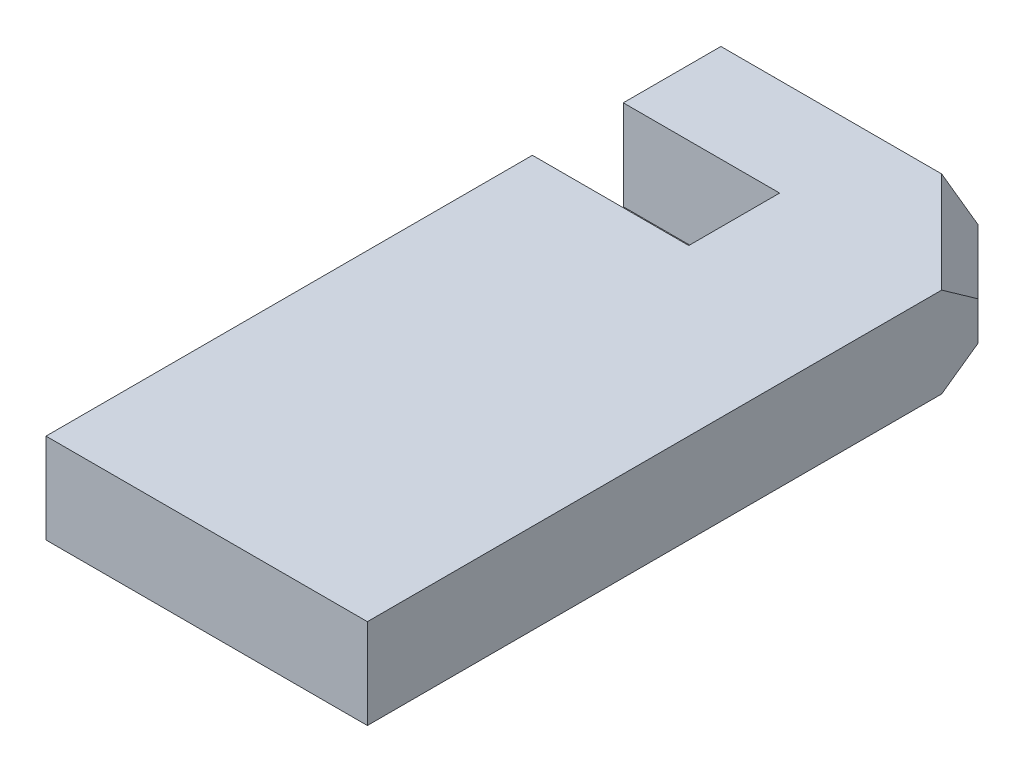
ISO-10303-21;
HEADER;
FILE_DESCRIPTION(('STEP AP214'),'2;1');
FILE_NAME('part.step','',(''),(''),'','','');
FILE_SCHEMA(('AUTOMOTIVE_DESIGN { 1 0 10303 214 1 1 1 1 }'));
ENDSEC;
DATA;
#1=APPLICATION_CONTEXT('core data for automotive mechanical design processes');
#2=APPLICATION_PROTOCOL_DEFINITION('international standard','automotive_design',2000,#1);
#3=PRODUCT_CONTEXT('',#1,'mechanical');
#4=PRODUCT('Part','Part','',(#3));
#5=PRODUCT_RELATED_PRODUCT_CATEGORY('part','',(#4));
#6=PRODUCT_DEFINITION_FORMATION('','',#4);
#7=PRODUCT_DEFINITION_CONTEXT('part definition',#1,'design');
#8=PRODUCT_DEFINITION('design','',#6,#7);
#9=PRODUCT_DEFINITION_SHAPE('','',#8);
#10=(LENGTH_UNIT() NAMED_UNIT(*) SI_UNIT(.MILLI.,.METRE.));
#11=(NAMED_UNIT(*) PLANE_ANGLE_UNIT() SI_UNIT($,.RADIAN.));
#12=(NAMED_UNIT(*) SI_UNIT($,.STERADIAN.) SOLID_ANGLE_UNIT());
#13=UNCERTAINTY_MEASURE_WITH_UNIT(LENGTH_MEASURE(1.E-05),#10,'distance_accuracy_value','');
#14=(GEOMETRIC_REPRESENTATION_CONTEXT(3) GLOBAL_UNCERTAINTY_ASSIGNED_CONTEXT((#13)) GLOBAL_UNIT_ASSIGNED_CONTEXT((#10,
#11,#12)) REPRESENTATION_CONTEXT('',''));
#15=CARTESIAN_POINT('',(0.,0.,0.));
#16=DIRECTION('',(0.,0.,1.));
#17=DIRECTION('',(1.,0.,0.));
#18=AXIS2_PLACEMENT_3D('',#15,#16,#17);
#19=CARTESIAN_POINT('',(0.,14.,0.));
#20=DIRECTION('',(1.,0.,0.));
#21=DIRECTION('',(0.,0.,-1.));
#22=AXIS2_PLACEMENT_3D('',#19,#20,#21);
#23=PLANE('',#22);
#24=DIRECTION('',(0.,0.,1.));
#25=VECTOR('',#24,1.);
#26=CARTESIAN_POINT('',(0.,0.,0.));
#27=LINE('',#26,#25);
#28=CARTESIAN_POINT('',(0.,0.,-75.6750475508893));
#29=VERTEX_POINT('',#28);
#30=CARTESIAN_POINT('',(0.,0.,0.));
#31=VERTEX_POINT('',#30);
#32=EDGE_CURVE('E147',#29,#31,#27,.T.);
#33=ORIENTED_EDGE('',*,*,#32,.T.);
#34=DIRECTION('',(0.,-1.,0.));
#35=VECTOR('',#34,1.);
#36=CARTESIAN_POINT('',(0.,14.,0.));
#37=LINE('',#36,#35);
#38=CARTESIAN_POINT('',(0.,14.,0.));
#39=VERTEX_POINT('',#38);
#40=EDGE_CURVE('E129',#39,#31,#37,.T.);
#41=ORIENTED_EDGE('',*,*,#40,.F.);
#42=DIRECTION('',(0.,0.,1.));
#43=VECTOR('',#42,1.);
#44=CARTESIAN_POINT('',(0.,14.,0.));
#45=LINE('',#44,#43);
#46=CARTESIAN_POINT('',(0.,14.,-75.6750475508893));
#47=VERTEX_POINT('',#46);
#48=EDGE_CURVE('E135',#47,#39,#45,.T.);
#49=ORIENTED_EDGE('',*,*,#48,.F.);
#50=DIRECTION('',(0.,-1.,0.));
#51=VECTOR('',#50,1.);
#52=CARTESIAN_POINT('',(0.,14.,-75.6750475508893));
#53=LINE('',#52,#51);
#54=EDGE_CURVE('E196',#47,#29,#53,.T.);
#55=ORIENTED_EDGE('',*,*,#54,.T.);
#56=EDGE_LOOP('',(#33,#41,#49,#55));
#57=FACE_BOUND('',#56,.T.);
#58=ADVANCED_FACE('F37',(#57),#23,.F.);
#59=CARTESIAN_POINT('',(0.,14.,0.));
#60=DIRECTION('',(0.,0.,-1.));
#61=DIRECTION('',(-1.,0.,0.));
#62=AXIS2_PLACEMENT_3D('',#59,#60,#61);
#63=PLANE('',#62);
#64=DIRECTION('',(1.,0.,0.));
#65=VECTOR('',#64,1.);
#66=CARTESIAN_POINT('',(0.,0.,0.));
#67=LINE('',#66,#65);
#68=CARTESIAN_POINT('',(50.,0.,0.));
#69=VERTEX_POINT('',#68);
#70=EDGE_CURVE('E188',#31,#69,#67,.T.);
#71=ORIENTED_EDGE('',*,*,#70,.T.);
#72=DIRECTION('',(0.,-1.,0.));
#73=VECTOR('',#72,1.);
#74=CARTESIAN_POINT('',(50.,14.,0.));
#75=LINE('',#74,#73);
#76=CARTESIAN_POINT('',(50.,14.,0.));
#77=VERTEX_POINT('',#76);
#78=EDGE_CURVE('E132',#77,#69,#75,.T.);
#79=ORIENTED_EDGE('',*,*,#78,.F.);
#80=DIRECTION('',(1.,0.,0.));
#81=VECTOR('',#80,1.);
#82=CARTESIAN_POINT('',(0.,14.,0.));
#83=LINE('',#82,#81);
#84=EDGE_CURVE('E125',#39,#77,#83,.T.);
#85=ORIENTED_EDGE('',*,*,#84,.F.);
#86=ORIENTED_EDGE('',*,*,#40,.T.);
#87=EDGE_LOOP('',(#71,#79,#85,#86));
#88=FACE_BOUND('',#87,.T.);
#89=ADVANCED_FACE('F127',(#88),#63,.F.);
#90=CARTESIAN_POINT('',(50.,14.,0.));
#91=DIRECTION('',(-1.,0.,0.));
#92=DIRECTION('',(0.,0.,1.));
#93=AXIS2_PLACEMENT_3D('',#90,#91,#92);
#94=PLANE('',#93);
#95=DIRECTION('',(0.,0.,-1.));
#96=VECTOR('',#95,1.);
#97=CARTESIAN_POINT('',(50.,0.,0.));
#98=LINE('',#97,#96);
#99=CARTESIAN_POINT('',(50.,0.,-89.3431457505076));
#100=VERTEX_POINT('',#99);
#101=EDGE_CURVE('E166',#69,#100,#98,.T.);
#102=ORIENTED_EDGE('',*,*,#101,.T.);
#103=DIRECTION('',(0.,0.577350269189623,-0.816496580927728));
#104=VECTOR('',#103,1.);
#105=CARTESIAN_POINT('',(50.,8.71404520791032,-101.666666666667));
#106=LINE('',#105,#104);
#107=CARTESIAN_POINT('',(50.,4.00000000000002,-95.));
#108=VERTEX_POINT('',#107);
#109=EDGE_CURVE('E46',#100,#108,#106,.T.);
#110=ORIENTED_EDGE('',*,*,#109,.T.);
#111=DIRECTION('',(0.,-1.,0.));
#112=VECTOR('',#111,1.);
#113=CARTESIAN_POINT('',(50.,14.,-95.));
#114=LINE('',#113,#112);
#115=CARTESIAN_POINT('',(50.,9.99999999999997,-95.));
#116=VERTEX_POINT('',#115);
#117=EDGE_CURVE('E152',#116,#108,#114,.T.);
#118=ORIENTED_EDGE('',*,*,#117,.F.);
#119=DIRECTION('',(0.,-0.57735026918963,-0.816496580927723));
#120=VECTOR('',#119,1.);
#121=CARTESIAN_POINT('',(50.,23.2732683844649,-76.2287638336719));
#122=LINE('',#121,#120);
#123=CARTESIAN_POINT('',(50.,14.,-89.3431457505076));
#124=VERTEX_POINT('',#123);
#125=EDGE_CURVE('E53',#116,#124,#122,.F.);
#126=ORIENTED_EDGE('',*,*,#125,.T.);
#127=DIRECTION('',(0.,0.,-1.));
#128=VECTOR('',#127,1.);
#129=CARTESIAN_POINT('',(50.,14.,0.));
#130=LINE('',#129,#128);
#131=EDGE_CURVE('E134',#77,#124,#130,.T.);
#132=ORIENTED_EDGE('',*,*,#131,.F.);
#133=ORIENTED_EDGE('',*,*,#78,.T.);
#134=EDGE_LOOP('',(#102,#110,#118,#126,#132,#133));
#135=FACE_BOUND('',#134,.T.);
#136=ADVANCED_FACE('F165',(#135),#94,.F.);
#137=CARTESIAN_POINT('',(40.,14.,-105.));
#138=DIRECTION('',(-0.707106781186547,0.,0.707106781186548));
#139=DIRECTION('',(0.707106781186548,0.,0.707106781186547));
#140=AXIS2_PLACEMENT_3D('',#137,#138,#139);
#141=PLANE('',#140);
#142=ORIENTED_EDGE('',*,*,#117,.T.);
#143=DIRECTION('',(-0.707106781186548,0.,-0.707106781186547));
#144=VECTOR('',#143,1.);
#145=CARTESIAN_POINT('',(40.,4.00000000000002,-105.));
#146=LINE('',#145,#144);
#147=CARTESIAN_POINT('',(40.,4.00000000000002,-105.));
#148=VERTEX_POINT('',#147);
#149=EDGE_CURVE('E150',#108,#148,#146,.T.);
#150=ORIENTED_EDGE('',*,*,#149,.T.);
#151=DIRECTION('',(0.,-1.,0.));
#152=VECTOR('',#151,1.);
#153=CARTESIAN_POINT('',(40.,14.,-105.));
#154=LINE('',#153,#152);
#155=CARTESIAN_POINT('',(40.,9.99999999999997,-105.));
#156=VERTEX_POINT('',#155);
#157=EDGE_CURVE('E174',#156,#148,#154,.T.);
#158=ORIENTED_EDGE('',*,*,#157,.F.);
#159=DIRECTION('',(0.707106781186548,0.,0.707106781186547));
#160=VECTOR('',#159,1.);
#161=CARTESIAN_POINT('',(40.,9.99999999999997,-105.));
#162=LINE('',#161,#160);
#163=EDGE_CURVE('E148',#156,#116,#162,.T.);
#164=ORIENTED_EDGE('',*,*,#163,.T.);
#165=EDGE_LOOP('',(#142,#150,#158,#164));
#166=FACE_BOUND('',#165,.T.);
#167=ADVANCED_FACE('F170',(#166),#141,.F.);
#168=CARTESIAN_POINT('',(0.,14.,-105.));
#169=DIRECTION('',(0.,0.,1.));
#170=DIRECTION('',(1.,0.,0.));
#171=AXIS2_PLACEMENT_3D('',#168,#169,#170);
#172=PLANE('',#171);
#173=ORIENTED_EDGE('',*,*,#157,.T.);
#174=DIRECTION('',(-0.816496580927728,-0.577350269189623,0.));
#175=VECTOR('',#174,1.);
#176=CARTESIAN_POINT('',(40.,4.00000000000002,-105.));
#177=LINE('',#176,#175);
#178=CARTESIAN_POINT('',(34.3431457505076,0.,-105.));
#179=VERTEX_POINT('',#178);
#180=EDGE_CURVE('E160',#148,#179,#177,.T.);
#181=ORIENTED_EDGE('',*,*,#180,.T.);
#182=DIRECTION('',(-1.,0.,0.));
#183=VECTOR('',#182,1.);
#184=CARTESIAN_POINT('',(0.,0.,-105.));
#185=LINE('',#184,#183);
#186=CARTESIAN_POINT('',(0.,0.,-105.));
#187=VERTEX_POINT('',#186);
#188=EDGE_CURVE('E179',#179,#187,#185,.T.);
#189=ORIENTED_EDGE('',*,*,#188,.T.);
#190=DIRECTION('',(0.,-1.,0.));
#191=VECTOR('',#190,1.);
#192=CARTESIAN_POINT('',(0.,14.,-105.));
#193=LINE('',#192,#191);
#194=CARTESIAN_POINT('',(0.,14.,-105.));
#195=VERTEX_POINT('',#194);
#196=EDGE_CURVE('E207',#195,#187,#193,.T.);
#197=ORIENTED_EDGE('',*,*,#196,.F.);
#198=DIRECTION('',(-1.,0.,0.));
#199=VECTOR('',#198,1.);
#200=CARTESIAN_POINT('',(0.,14.,-105.));
#201=LINE('',#200,#199);
#202=CARTESIAN_POINT('',(34.3431457505076,14.,-105.));
#203=VERTEX_POINT('',#202);
#204=EDGE_CURVE('E215',#203,#195,#201,.T.);
#205=ORIENTED_EDGE('',*,*,#204,.F.);
#206=DIRECTION('',(-0.816496580927723,0.57735026918963,0.));
#207=VECTOR('',#206,1.);
#208=CARTESIAN_POINT('',(57.8954305003382,-2.65398025904191,-105.));
#209=LINE('',#208,#207);
#210=EDGE_CURVE('E158',#203,#156,#209,.F.);
#211=ORIENTED_EDGE('',*,*,#210,.T.);
#212=EDGE_LOOP('',(#173,#181,#189,#197,#205,#211));
#213=FACE_BOUND('',#212,.T.);
#214=ADVANCED_FACE('F177',(#213),#172,.F.);
#215=CARTESIAN_POINT('',(0.,14.,-89.8139548714818));
#216=DIRECTION('',(1.,0.,0.));
#217=DIRECTION('',(0.,0.,-1.));
#218=AXIS2_PLACEMENT_3D('',#215,#216,#217);
#219=PLANE('',#218);
#220=DIRECTION('',(0.,0.,1.));
#221=VECTOR('',#220,1.);
#222=CARTESIAN_POINT('',(0.,0.,-89.8139548714818));
#223=LINE('',#222,#221);
#224=CARTESIAN_POINT('',(0.,0.,-89.8139548714818));
#225=VERTEX_POINT('',#224);
#226=EDGE_CURVE('E184',#187,#225,#223,.T.);
#227=ORIENTED_EDGE('',*,*,#226,.T.);
#228=DIRECTION('',(0.,-1.,0.));
#229=VECTOR('',#228,1.);
#230=CARTESIAN_POINT('',(0.,14.,-89.8139548714818));
#231=LINE('',#230,#229);
#232=CARTESIAN_POINT('',(0.,14.,-89.8139548714818));
#233=VERTEX_POINT('',#232);
#234=EDGE_CURVE('E204',#233,#225,#231,.T.);
#235=ORIENTED_EDGE('',*,*,#234,.F.);
#236=DIRECTION('',(0.,0.,1.));
#237=VECTOR('',#236,1.);
#238=CARTESIAN_POINT('',(0.,14.,-89.8139548714818));
#239=LINE('',#238,#237);
#240=EDGE_CURVE('E213',#195,#233,#239,.T.);
#241=ORIENTED_EDGE('',*,*,#240,.F.);
#242=ORIENTED_EDGE('',*,*,#196,.T.);
#243=EDGE_LOOP('',(#227,#235,#241,#242));
#244=FACE_BOUND('',#243,.T.);
#245=ADVANCED_FACE('F211',(#244),#219,.F.);
#246=CARTESIAN_POINT('',(0.,14.,-89.8139548714818));
#247=DIRECTION('',(0.,0.,-1.));
#248=DIRECTION('',(-1.,0.,0.));
#249=AXIS2_PLACEMENT_3D('',#246,#247,#248);
#250=PLANE('',#249);
#251=DIRECTION('',(1.,0.,0.));
#252=VECTOR('',#251,1.);
#253=CARTESIAN_POINT('',(0.,0.,-89.8139548714818));
#254=LINE('',#253,#252);
#255=CARTESIAN_POINT('',(24.325372692006,0.,-89.8139548714818));
#256=VERTEX_POINT('',#255);
#257=EDGE_CURVE('E186',#225,#256,#254,.T.);
#258=ORIENTED_EDGE('',*,*,#257,.T.);
#259=DIRECTION('',(0.,-1.,0.));
#260=VECTOR('',#259,1.);
#261=CARTESIAN_POINT('',(24.325372692006,14.,-89.8139548714818));
#262=LINE('',#261,#260);
#263=CARTESIAN_POINT('',(24.325372692006,14.,-89.8139548714818));
#264=VERTEX_POINT('',#263);
#265=EDGE_CURVE('E201',#264,#256,#262,.T.);
#266=ORIENTED_EDGE('',*,*,#265,.F.);
#267=DIRECTION('',(1.,0.,0.));
#268=VECTOR('',#267,1.);
#269=CARTESIAN_POINT('',(0.,14.,-89.8139548714818));
#270=LINE('',#269,#268);
#271=EDGE_CURVE('E217',#233,#264,#270,.T.);
#272=ORIENTED_EDGE('',*,*,#271,.F.);
#273=ORIENTED_EDGE('',*,*,#234,.T.);
#274=EDGE_LOOP('',(#258,#266,#272,#273));
#275=FACE_BOUND('',#274,.T.);
#276=ADVANCED_FACE('F251',(#275),#250,.F.);
#277=CARTESIAN_POINT('',(24.325372692006,14.,-89.8139548714818));
#278=DIRECTION('',(1.,0.,0.));
#279=DIRECTION('',(0.,0.,-1.));
#280=AXIS2_PLACEMENT_3D('',#277,#278,#279);
#281=PLANE('',#280);
#282=DIRECTION('',(0.,0.,1.));
#283=VECTOR('',#282,1.);
#284=CARTESIAN_POINT('',(24.325372692006,0.,-89.8139548714818));
#285=LINE('',#284,#283);
#286=CARTESIAN_POINT('',(24.325372692006,0.,-75.6750475508893));
#287=VERTEX_POINT('',#286);
#288=EDGE_CURVE('E193',#256,#287,#285,.T.);
#289=ORIENTED_EDGE('',*,*,#288,.T.);
#290=DIRECTION('',(0.,-1.,0.));
#291=VECTOR('',#290,1.);
#292=CARTESIAN_POINT('',(24.325372692006,14.,-75.6750475508893));
#293=LINE('',#292,#291);
#294=CARTESIAN_POINT('',(24.325372692006,14.,-75.6750475508893));
#295=VERTEX_POINT('',#294);
#296=EDGE_CURVE('E198',#295,#287,#293,.T.);
#297=ORIENTED_EDGE('',*,*,#296,.F.);
#298=DIRECTION('',(0.,0.,1.));
#299=VECTOR('',#298,1.);
#300=CARTESIAN_POINT('',(24.325372692006,14.,-89.8139548714818));
#301=LINE('',#300,#299);
#302=EDGE_CURVE('E222',#264,#295,#301,.T.);
#303=ORIENTED_EDGE('',*,*,#302,.F.);
#304=ORIENTED_EDGE('',*,*,#265,.T.);
#305=EDGE_LOOP('',(#289,#297,#303,#304));
#306=FACE_BOUND('',#305,.T.);
#307=ADVANCED_FACE('F254',(#306),#281,.F.);
#308=CARTESIAN_POINT('',(0.,14.,-75.6750475508893));
#309=DIRECTION('',(0.,0.,1.));
#310=DIRECTION('',(1.,0.,0.));
#311=AXIS2_PLACEMENT_3D('',#308,#309,#310);
#312=PLANE('',#311);
#313=DIRECTION('',(-1.,0.,0.));
#314=VECTOR('',#313,1.);
#315=CARTESIAN_POINT('',(0.,0.,-75.6750475508893));
#316=LINE('',#315,#314);
#317=EDGE_CURVE('E144',#287,#29,#316,.T.);
#318=ORIENTED_EDGE('',*,*,#317,.T.);
#319=ORIENTED_EDGE('',*,*,#54,.F.);
#320=DIRECTION('',(-1.,0.,0.));
#321=VECTOR('',#320,1.);
#322=CARTESIAN_POINT('',(0.,14.,-75.6750475508893));
#323=LINE('',#322,#321);
#324=EDGE_CURVE('E140',#295,#47,#323,.T.);
#325=ORIENTED_EDGE('',*,*,#324,.F.);
#326=ORIENTED_EDGE('',*,*,#296,.T.);
#327=EDGE_LOOP('',(#318,#319,#325,#326));
#328=FACE_BOUND('',#327,.T.);
#329=ADVANCED_FACE('F258',(#328),#312,.F.);
#330=CARTESIAN_POINT('',(0.,14.,0.));
#331=DIRECTION('',(0.,-1.,0.));
#332=DIRECTION('',(0.,0.,-1.));
#333=AXIS2_PLACEMENT_3D('',#330,#331,#332);
#334=PLANE('',#333);
#335=ORIENTED_EDGE('',*,*,#131,.T.);
#336=DIRECTION('',(-0.707106781186548,0.,-0.707106781186547));
#337=VECTOR('',#336,1.);
#338=CARTESIAN_POINT('',(69.6715728752538,14.,-69.6715728752539));
#339=LINE('',#338,#337);
#340=EDGE_CURVE('E11',#124,#203,#339,.T.);
#341=ORIENTED_EDGE('',*,*,#340,.T.);
#342=ORIENTED_EDGE('',*,*,#204,.T.);
#343=ORIENTED_EDGE('',*,*,#240,.T.);
#344=ORIENTED_EDGE('',*,*,#271,.T.);
#345=ORIENTED_EDGE('',*,*,#302,.T.);
#346=ORIENTED_EDGE('',*,*,#324,.T.);
#347=ORIENTED_EDGE('',*,*,#48,.T.);
#348=ORIENTED_EDGE('',*,*,#84,.T.);
#349=EDGE_LOOP('',(#335,#341,#342,#343,#344,#345,#346,#347,#348));
#350=FACE_BOUND('',#349,.T.);
#351=ADVANCED_FACE('F138',(#350),#334,.F.);
#352=CARTESIAN_POINT('',(0.,0.,0.));
#353=DIRECTION('',(0.,-1.,0.));
#354=DIRECTION('',(0.,0.,-1.));
#355=AXIS2_PLACEMENT_3D('',#352,#353,#354);
#356=PLANE('',#355);
#357=ORIENTED_EDGE('',*,*,#188,.F.);
#358=DIRECTION('',(0.707106781186548,0.,0.707106781186547));
#359=VECTOR('',#358,1.);
#360=CARTESIAN_POINT('',(47.1715728752538,0.,-92.1715728752538));
#361=LINE('',#360,#359);
#362=EDGE_CURVE('E61',#179,#100,#361,.T.);
#363=ORIENTED_EDGE('',*,*,#362,.T.);
#364=ORIENTED_EDGE('',*,*,#101,.F.);
#365=ORIENTED_EDGE('',*,*,#70,.F.);
#366=ORIENTED_EDGE('',*,*,#32,.F.);
#367=ORIENTED_EDGE('',*,*,#317,.F.);
#368=ORIENTED_EDGE('',*,*,#288,.F.);
#369=ORIENTED_EDGE('',*,*,#257,.F.);
#370=ORIENTED_EDGE('',*,*,#226,.F.);
#371=EDGE_LOOP('',(#357,#363,#364,#365,#366,#367,#368,#369,#370));
#372=FACE_BOUND('',#371,.T.);
#373=ADVANCED_FACE('F182',(#372),#356,.T.);
#374=CARTESIAN_POINT('',(40.,4.00000000000002,-105.));
#375=DIRECTION('',(0.499999999999998,-0.70710678118655,-0.499999999999998));
#376=DIRECTION('',(0.707106781186548,0.,0.707106781186547));
#377=AXIS2_PLACEMENT_3D('',#374,#375,#376);
#378=PLANE('',#377);
#379=ORIENTED_EDGE('',*,*,#109,.F.);
#380=ORIENTED_EDGE('',*,*,#362,.F.);
#381=ORIENTED_EDGE('',*,*,#180,.F.);
#382=ORIENTED_EDGE('',*,*,#149,.F.);
#383=EDGE_LOOP('',(#379,#380,#381,#382));
#384=FACE_BOUND('',#383,.T.);
#385=ADVANCED_FACE('F175',(#384),#378,.T.);
#386=CARTESIAN_POINT('',(69.6715728752538,14.,-69.6715728752539));
#387=DIRECTION('',(-0.500000000000003,-0.707106781186544,0.500000000000003));
#388=DIRECTION('',(-0.707106781186548,0.,-0.707106781186547));
#389=AXIS2_PLACEMENT_3D('',#386,#387,#388);
#390=PLANE('',#389);
#391=ORIENTED_EDGE('',*,*,#125,.F.);
#392=ORIENTED_EDGE('',*,*,#163,.F.);
#393=ORIENTED_EDGE('',*,*,#210,.F.);
#394=ORIENTED_EDGE('',*,*,#340,.F.);
#395=EDGE_LOOP('',(#391,#392,#393,#394));
#396=FACE_BOUND('',#395,.T.);
#397=ADVANCED_FACE('F40',(#396),#390,.F.);
#398=CLOSED_SHELL('',(#58,#89,#136,#167,#214,#245,#276,#307,#329,#351,#373,#385,#397));
#399=MANIFOLD_SOLID_BREP('B2',#398);
#400=ADVANCED_BREP_SHAPE_REPRESENTATION('',(#18,#399),#14);
#401=SHAPE_DEFINITION_REPRESENTATION(#9,#400);
ENDSEC;
END-ISO-10303-21;
